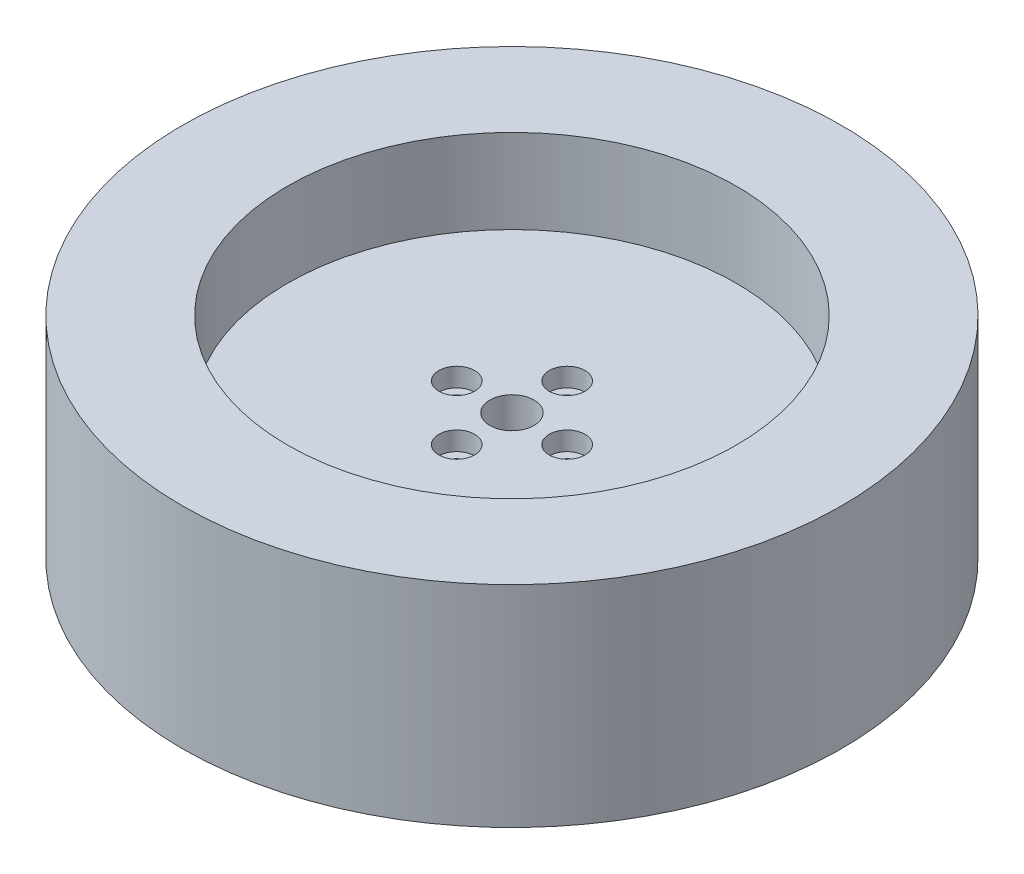
ISO-10303-21;
HEADER;
FILE_DESCRIPTION(('STEP AP214'),'2;1');
FILE_NAME('part.step','',(''),(''),'','','');
FILE_SCHEMA(('AUTOMOTIVE_DESIGN { 1 0 10303 214 1 1 1 1 }'));
ENDSEC;
DATA;
#1=APPLICATION_CONTEXT('core data for automotive mechanical design processes');
#2=APPLICATION_PROTOCOL_DEFINITION('international standard','automotive_design',2000,#1);
#3=PRODUCT_CONTEXT('',#1,'mechanical');
#4=PRODUCT('Part','Part','',(#3));
#5=PRODUCT_RELATED_PRODUCT_CATEGORY('part','',(#4));
#6=PRODUCT_DEFINITION_FORMATION('','',#4);
#7=PRODUCT_DEFINITION_CONTEXT('part definition',#1,'design');
#8=PRODUCT_DEFINITION('design','',#6,#7);
#9=PRODUCT_DEFINITION_SHAPE('','',#8);
#10=(LENGTH_UNIT() NAMED_UNIT(*) SI_UNIT(.MILLI.,.METRE.));
#11=(NAMED_UNIT(*) PLANE_ANGLE_UNIT() SI_UNIT($,.RADIAN.));
#12=(NAMED_UNIT(*) SI_UNIT($,.STERADIAN.) SOLID_ANGLE_UNIT());
#13=UNCERTAINTY_MEASURE_WITH_UNIT(LENGTH_MEASURE(1.E-05),#10,'distance_accuracy_value','');
#14=(GEOMETRIC_REPRESENTATION_CONTEXT(3) GLOBAL_UNCERTAINTY_ASSIGNED_CONTEXT((#13)) GLOBAL_UNIT_ASSIGNED_CONTEXT((#10,
#11,#12)) REPRESENTATION_CONTEXT('',''));
#15=CARTESIAN_POINT('',(0.,0.,0.));
#16=DIRECTION('',(0.,0.,1.));
#17=DIRECTION('',(1.,0.,0.));
#18=AXIS2_PLACEMENT_3D('',#15,#16,#17);
#19=CARTESIAN_POINT('',(0.,-21.19,0.));
#20=DIRECTION('',(0.,1.,0.));
#21=DIRECTION('',(0.,0.,1.));
#22=AXIS2_PLACEMENT_3D('',#19,#20,#21);
#23=CYLINDRICAL_SURFACE('',#22,4.);
#24=CARTESIAN_POINT('',(0.,3.81,0.));
#25=DIRECTION('',(0.,1.,0.));
#26=DIRECTION('',(0.,0.,1.));
#27=AXIS2_PLACEMENT_3D('',#24,#25,#26);
#28=CIRCLE('',#27,4.);
#29=CARTESIAN_POINT('',(0.,3.81,4.));
#30=VERTEX_POINT('',#29);
#31=EDGE_CURVE('E73',#30,#30,#28,.T.);
#32=ORIENTED_EDGE('',*,*,#31,.T.);
#33=EDGE_LOOP('',(#32));
#34=FACE_BOUND('',#33,.T.);
#35=CARTESIAN_POINT('',(0.,-1.81,0.));
#36=DIRECTION('',(0.,-1.,0.));
#37=DIRECTION('',(0.,0.,-1.));
#38=AXIS2_PLACEMENT_3D('',#35,#36,#37);
#39=CIRCLE('',#38,4.);
#40=CARTESIAN_POINT('',(0.,-1.81,-4.));
#41=VERTEX_POINT('',#40);
#42=EDGE_CURVE('E115',#41,#41,#39,.F.);
#43=ORIENTED_EDGE('',*,*,#42,.F.);
#44=EDGE_LOOP('',(#43));
#45=FACE_BOUND('',#44,.T.);
#46=ADVANCED_FACE('F49',(#34,#45),#23,.F.);
#47=CARTESIAN_POINT('',(0.,-6.19,10.));
#48=DIRECTION('',(0.,1.,0.));
#49=DIRECTION('',(0.,0.,1.));
#50=AXIS2_PLACEMENT_3D('',#47,#48,#49);
#51=CYLINDRICAL_SURFACE('',#50,1.7);
#52=CARTESIAN_POINT('',(0.,0.410000000000003,10.));
#53=DIRECTION('',(0.,1.,0.));
#54=DIRECTION('',(0.,0.,1.));
#55=AXIS2_PLACEMENT_3D('',#52,#53,#54);
#56=CIRCLE('',#55,1.7);
#57=CARTESIAN_POINT('',(0.,0.410000000000003,11.7));
#58=VERTEX_POINT('',#57);
#59=EDGE_CURVE('E104',#58,#58,#56,.T.);
#60=ORIENTED_EDGE('',*,*,#59,.T.);
#61=EDGE_LOOP('',(#60));
#62=FACE_BOUND('',#61,.T.);
#63=CARTESIAN_POINT('',(0.,-1.81,10.));
#64=DIRECTION('',(0.,-1.,0.));
#65=DIRECTION('',(0.,0.,-1.));
#66=AXIS2_PLACEMENT_3D('',#63,#64,#65);
#67=CIRCLE('',#66,1.7);
#68=CARTESIAN_POINT('',(0.,-1.81,8.3));
#69=VERTEX_POINT('',#68);
#70=EDGE_CURVE('E118',#69,#69,#67,.F.);
#71=ORIENTED_EDGE('',*,*,#70,.F.);
#72=EDGE_LOOP('',(#71));
#73=FACE_BOUND('',#72,.T.);
#74=ADVANCED_FACE('F155',(#62,#73),#51,.F.);
#75=CARTESIAN_POINT('',(-10.,-6.19,1.05969086964441E-13));
#76=DIRECTION('',(0.,1.,0.));
#77=DIRECTION('',(0.,0.,1.));
#78=AXIS2_PLACEMENT_3D('',#75,#76,#77);
#79=CYLINDRICAL_SURFACE('',#78,1.7);
#80=CARTESIAN_POINT('',(-10.,0.410000000000003,1.05969086964441E-13));
#81=DIRECTION('',(0.,1.,0.));
#82=DIRECTION('',(0.,0.,1.));
#83=AXIS2_PLACEMENT_3D('',#80,#81,#82);
#84=CIRCLE('',#83,1.7);
#85=CARTESIAN_POINT('',(-10.,0.410000000000003,1.7000000000001));
#86=VERTEX_POINT('',#85);
#87=EDGE_CURVE('E78',#86,#86,#84,.T.);
#88=ORIENTED_EDGE('',*,*,#87,.T.);
#89=EDGE_LOOP('',(#88));
#90=FACE_BOUND('',#89,.T.);
#91=CARTESIAN_POINT('',(-10.,-1.81,1.05969086964441E-13));
#92=DIRECTION('',(0.,-1.,0.));
#93=DIRECTION('',(0.,0.,-1.));
#94=AXIS2_PLACEMENT_3D('',#91,#92,#93);
#95=CIRCLE('',#94,1.7);
#96=CARTESIAN_POINT('',(-10.,-1.81,-1.69999999999989));
#97=VERTEX_POINT('',#96);
#98=EDGE_CURVE('E121',#97,#97,#95,.F.);
#99=ORIENTED_EDGE('',*,*,#98,.F.);
#100=EDGE_LOOP('',(#99));
#101=FACE_BOUND('',#100,.T.);
#102=ADVANCED_FACE('F150',(#90,#101),#79,.F.);
#103=CARTESIAN_POINT('',(0.,-6.19,-10.));
#104=DIRECTION('',(0.,1.,0.));
#105=DIRECTION('',(0.,0.,1.));
#106=AXIS2_PLACEMENT_3D('',#103,#104,#105);
#107=CYLINDRICAL_SURFACE('',#106,1.7);
#108=CARTESIAN_POINT('',(0.,0.410000000000003,-10.));
#109=DIRECTION('',(0.,1.,0.));
#110=DIRECTION('',(0.,0.,1.));
#111=AXIS2_PLACEMENT_3D('',#108,#109,#110);
#112=CIRCLE('',#111,1.7);
#113=CARTESIAN_POINT('',(0.,0.410000000000003,-8.3));
#114=VERTEX_POINT('',#113);
#115=EDGE_CURVE('E87',#114,#114,#112,.T.);
#116=ORIENTED_EDGE('',*,*,#115,.T.);
#117=EDGE_LOOP('',(#116));
#118=FACE_BOUND('',#117,.T.);
#119=CARTESIAN_POINT('',(0.,-1.81,-10.));
#120=DIRECTION('',(0.,-1.,0.));
#121=DIRECTION('',(0.,0.,-1.));
#122=AXIS2_PLACEMENT_3D('',#119,#120,#121);
#123=CIRCLE('',#122,1.7);
#124=CARTESIAN_POINT('',(0.,-1.81,-11.7));
#125=VERTEX_POINT('',#124);
#126=EDGE_CURVE('E124',#125,#125,#123,.F.);
#127=ORIENTED_EDGE('',*,*,#126,.F.);
#128=EDGE_LOOP('',(#127));
#129=FACE_BOUND('',#128,.T.);
#130=ADVANCED_FACE('F142',(#118,#129),#107,.F.);
#131=CARTESIAN_POINT('',(10.,-6.19,0.));
#132=DIRECTION('',(0.,1.,0.));
#133=DIRECTION('',(0.,0.,1.));
#134=AXIS2_PLACEMENT_3D('',#131,#132,#133);
#135=CYLINDRICAL_SURFACE('',#134,1.7);
#136=CARTESIAN_POINT('',(10.,0.410000000000003,0.));
#137=DIRECTION('',(0.,1.,0.));
#138=DIRECTION('',(0.,0.,1.));
#139=AXIS2_PLACEMENT_3D('',#136,#137,#138);
#140=CIRCLE('',#139,1.7);
#141=CARTESIAN_POINT('',(10.,0.410000000000003,1.69999999999996));
#142=VERTEX_POINT('',#141);
#143=EDGE_CURVE('E96',#142,#142,#140,.T.);
#144=ORIENTED_EDGE('',*,*,#143,.T.);
#145=EDGE_LOOP('',(#144));
#146=FACE_BOUND('',#145,.T.);
#147=CARTESIAN_POINT('',(10.,-1.81,0.));
#148=DIRECTION('',(0.,-1.,0.));
#149=DIRECTION('',(0.,0.,-1.));
#150=AXIS2_PLACEMENT_3D('',#147,#148,#149);
#151=CIRCLE('',#150,1.7);
#152=CARTESIAN_POINT('',(10.,-1.81,-1.70000000000004));
#153=VERTEX_POINT('',#152);
#154=EDGE_CURVE('E53',#153,#153,#151,.F.);
#155=ORIENTED_EDGE('',*,*,#154,.F.);
#156=EDGE_LOOP('',(#155));
#157=FACE_BOUND('',#156,.T.);
#158=ADVANCED_FACE('F140',(#146,#157),#135,.F.);
#159=CARTESIAN_POINT('',(0.,-19.05,0.));
#160=DIRECTION('',(0.,1.,0.));
#161=DIRECTION('',(0.,0.,1.));
#162=AXIS2_PLACEMENT_3D('',#159,#160,#161);
#163=CYLINDRICAL_SURFACE('',#162,59.69);
#164=CARTESIAN_POINT('',(0.,-19.05,0.));
#165=DIRECTION('',(0.,1.,0.));
#166=DIRECTION('',(0.,0.,1.));
#167=AXIS2_PLACEMENT_3D('',#164,#165,#166);
#168=CIRCLE('',#167,59.69);
#169=CARTESIAN_POINT('',(0.,-19.05,59.69));
#170=VERTEX_POINT('',#169);
#171=EDGE_CURVE('E11',#170,#170,#168,.T.);
#172=ORIENTED_EDGE('',*,*,#171,.T.);
#173=EDGE_LOOP('',(#172));
#174=FACE_BOUND('',#173,.T.);
#175=CARTESIAN_POINT('',(0.,19.05,0.));
#176=DIRECTION('',(0.,1.,0.));
#177=DIRECTION('',(0.,0.,1.));
#178=AXIS2_PLACEMENT_3D('',#175,#176,#177);
#179=CIRCLE('',#178,59.69);
#180=CARTESIAN_POINT('',(0.,19.05,59.69));
#181=VERTEX_POINT('',#180);
#182=EDGE_CURVE('E57',#181,#181,#179,.T.);
#183=ORIENTED_EDGE('',*,*,#182,.F.);
#184=EDGE_LOOP('',(#183));
#185=FACE_BOUND('',#184,.T.);
#186=ADVANCED_FACE('F51',(#174,#185),#163,.T.);
#187=CARTESIAN_POINT('',(0.,-19.05,0.));
#188=DIRECTION('',(0.,1.,0.));
#189=DIRECTION('',(0.,0.,1.));
#190=AXIS2_PLACEMENT_3D('',#187,#188,#189);
#191=PLANE('',#190);
#192=CARTESIAN_POINT('',(0.,-19.05,0.));
#193=DIRECTION('',(0.,-1.,0.));
#194=DIRECTION('',(0.,0.,-1.));
#195=AXIS2_PLACEMENT_3D('',#192,#193,#194);
#196=CIRCLE('',#195,40.64);
#197=CARTESIAN_POINT('',(0.,-19.05,-40.64));
#198=VERTEX_POINT('',#197);
#199=EDGE_CURVE('E64',#198,#198,#196,.T.);
#200=ORIENTED_EDGE('',*,*,#199,.F.);
#201=EDGE_LOOP('',(#200));
#202=FACE_BOUND('',#201,.T.);
#203=ORIENTED_EDGE('',*,*,#171,.F.);
#204=EDGE_LOOP('',(#203));
#205=FACE_BOUND('',#204,.T.);
#206=ADVANCED_FACE('F149',(#202,#205),#191,.F.);
#207=CARTESIAN_POINT('',(0.,19.05,0.));
#208=DIRECTION('',(0.,1.,0.));
#209=DIRECTION('',(0.,0.,1.));
#210=AXIS2_PLACEMENT_3D('',#207,#208,#209);
#211=PLANE('',#210);
#212=CARTESIAN_POINT('',(0.,19.05,0.));
#213=DIRECTION('',(0.,1.,0.));
#214=DIRECTION('',(0.,0.,1.));
#215=AXIS2_PLACEMENT_3D('',#212,#213,#214);
#216=CIRCLE('',#215,40.64);
#217=CARTESIAN_POINT('',(0.,19.05,40.64));
#218=VERTEX_POINT('',#217);
#219=EDGE_CURVE('E70',#218,#218,#216,.T.);
#220=ORIENTED_EDGE('',*,*,#219,.F.);
#221=EDGE_LOOP('',(#220));
#222=FACE_BOUND('',#221,.T.);
#223=ORIENTED_EDGE('',*,*,#182,.T.);
#224=EDGE_LOOP('',(#223));
#225=FACE_BOUND('',#224,.T.);
#226=ADVANCED_FACE('F181',(#222,#225),#211,.T.);
#227=CARTESIAN_POINT('',(0.,-3.81,0.));
#228=DIRECTION('',(0.,-1.,0.));
#229=DIRECTION('',(0.,0.,-1.));
#230=AXIS2_PLACEMENT_3D('',#227,#228,#229);
#231=CYLINDRICAL_SURFACE('',#230,40.64);
#232=CARTESIAN_POINT('',(0.,-3.81,0.));
#233=DIRECTION('',(0.,-1.,0.));
#234=DIRECTION('',(0.,0.,-1.));
#235=AXIS2_PLACEMENT_3D('',#232,#233,#234);
#236=CIRCLE('',#235,40.64);
#237=CARTESIAN_POINT('',(0.,-3.81,-40.64));
#238=VERTEX_POINT('',#237);
#239=EDGE_CURVE('E61',#238,#238,#236,.T.);
#240=ORIENTED_EDGE('',*,*,#239,.F.);
#241=EDGE_LOOP('',(#240));
#242=FACE_BOUND('',#241,.T.);
#243=ORIENTED_EDGE('',*,*,#199,.T.);
#244=EDGE_LOOP('',(#243));
#245=FACE_BOUND('',#244,.T.);
#246=ADVANCED_FACE('F177',(#242,#245),#231,.F.);
#247=CARTESIAN_POINT('',(0.,-3.81,0.));
#248=DIRECTION('',(0.,-1.,0.));
#249=DIRECTION('',(0.,0.,-1.));
#250=AXIS2_PLACEMENT_3D('',#247,#248,#249);
#251=PLANE('',#250);
#252=CARTESIAN_POINT('',(0.,-3.81,0.));
#253=DIRECTION('',(0.,-1.,0.));
#254=DIRECTION('',(0.,0.,-1.));
#255=AXIS2_PLACEMENT_3D('',#252,#253,#254);
#256=CIRCLE('',#255,15.);
#257=CARTESIAN_POINT('',(0.,-3.81,-15.));
#258=VERTEX_POINT('',#257);
#259=EDGE_CURVE('E127',#258,#258,#256,.T.);
#260=ORIENTED_EDGE('',*,*,#259,.F.);
#261=EDGE_LOOP('',(#260));
#262=FACE_BOUND('',#261,.T.);
#263=ORIENTED_EDGE('',*,*,#239,.T.);
#264=EDGE_LOOP('',(#263));
#265=FACE_BOUND('',#264,.T.);
#266=ADVANCED_FACE('F173',(#262,#265),#251,.T.);
#267=CARTESIAN_POINT('',(0.,3.81,0.));
#268=DIRECTION('',(0.,1.,0.));
#269=DIRECTION('',(0.,0.,1.));
#270=AXIS2_PLACEMENT_3D('',#267,#268,#269);
#271=CYLINDRICAL_SURFACE('',#270,40.64);
#272=CARTESIAN_POINT('',(0.,3.81,0.));
#273=DIRECTION('',(0.,1.,0.));
#274=DIRECTION('',(0.,0.,1.));
#275=AXIS2_PLACEMENT_3D('',#272,#273,#274);
#276=CIRCLE('',#275,40.64);
#277=CARTESIAN_POINT('',(0.,3.81,40.64));
#278=VERTEX_POINT('',#277);
#279=EDGE_CURVE('E67',#278,#278,#276,.T.);
#280=ORIENTED_EDGE('',*,*,#279,.F.);
#281=EDGE_LOOP('',(#280));
#282=FACE_BOUND('',#281,.T.);
#283=ORIENTED_EDGE('',*,*,#219,.T.);
#284=EDGE_LOOP('',(#283));
#285=FACE_BOUND('',#284,.T.);
#286=ADVANCED_FACE('F169',(#282,#285),#271,.F.);
#287=CARTESIAN_POINT('',(0.,3.81,0.));
#288=DIRECTION('',(0.,1.,0.));
#289=DIRECTION('',(0.,0.,1.));
#290=AXIS2_PLACEMENT_3D('',#287,#288,#289);
#291=PLANE('',#290);
#292=CARTESIAN_POINT('',(0.,3.81,10.));
#293=DIRECTION('',(0.,1.,0.));
#294=DIRECTION('',(0.,0.,1.));
#295=AXIS2_PLACEMENT_3D('',#292,#293,#294);
#296=CIRCLE('',#295,3.25);
#297=CARTESIAN_POINT('',(0.,3.81,13.25));
#298=VERTEX_POINT('',#297);
#299=EDGE_CURVE('E112',#298,#298,#296,.T.);
#300=ORIENTED_EDGE('',*,*,#299,.F.);
#301=EDGE_LOOP('',(#300));
#302=FACE_BOUND('',#301,.T.);
#303=CARTESIAN_POINT('',(10.,3.81,0.));
#304=DIRECTION('',(0.,1.,0.));
#305=DIRECTION('',(0.,0.,1.));
#306=AXIS2_PLACEMENT_3D('',#303,#304,#305);
#307=CIRCLE('',#306,3.25);
#308=CARTESIAN_POINT('',(10.,3.81,3.24999999999996));
#309=VERTEX_POINT('',#308);
#310=EDGE_CURVE('E102',#309,#309,#307,.T.);
#311=ORIENTED_EDGE('',*,*,#310,.F.);
#312=EDGE_LOOP('',(#311));
#313=FACE_BOUND('',#312,.T.);
#314=CARTESIAN_POINT('',(0.,3.81,-10.));
#315=DIRECTION('',(0.,1.,0.));
#316=DIRECTION('',(0.,0.,1.));
#317=AXIS2_PLACEMENT_3D('',#314,#315,#316);
#318=CIRCLE('',#317,3.25);
#319=CARTESIAN_POINT('',(0.,3.81,-6.75));
#320=VERTEX_POINT('',#319);
#321=EDGE_CURVE('E93',#320,#320,#318,.T.);
#322=ORIENTED_EDGE('',*,*,#321,.F.);
#323=EDGE_LOOP('',(#322));
#324=FACE_BOUND('',#323,.T.);
#325=CARTESIAN_POINT('',(-10.,3.81,1.05969086964441E-13));
#326=DIRECTION('',(0.,1.,0.));
#327=DIRECTION('',(0.,0.,1.));
#328=AXIS2_PLACEMENT_3D('',#325,#326,#327);
#329=CIRCLE('',#328,3.25);
#330=CARTESIAN_POINT('',(-10.,3.81,3.25000000000011));
#331=VERTEX_POINT('',#330);
#332=EDGE_CURVE('E84',#331,#331,#329,.T.);
#333=ORIENTED_EDGE('',*,*,#332,.F.);
#334=EDGE_LOOP('',(#333));
#335=FACE_BOUND('',#334,.T.);
#336=ORIENTED_EDGE('',*,*,#31,.F.);
#337=EDGE_LOOP('',(#336));
#338=FACE_BOUND('',#337,.T.);
#339=ORIENTED_EDGE('',*,*,#279,.T.);
#340=EDGE_LOOP('',(#339));
#341=FACE_BOUND('',#340,.T.);
#342=ADVANCED_FACE('F165',(#302,#313,#324,#335,#338,#341),#291,.T.);
#343=CARTESIAN_POINT('',(-8.3,0.410000000000003,1.05969086964441E-13));
#344=DIRECTION('',(0.,-1.,0.));
#345=DIRECTION('',(0.,0.,-1.));
#346=AXIS2_PLACEMENT_3D('',#343,#344,#345);
#347=PLANE('',#346);
#348=ORIENTED_EDGE('',*,*,#87,.F.);
#349=EDGE_LOOP('',(#348));
#350=FACE_BOUND('',#349,.T.);
#351=CARTESIAN_POINT('',(-10.,0.410000000000003,1.05969086964441E-13));
#352=DIRECTION('',(0.,1.,0.));
#353=DIRECTION('',(0.,0.,1.));
#354=AXIS2_PLACEMENT_3D('',#351,#352,#353);
#355=CIRCLE('',#354,3.25);
#356=CARTESIAN_POINT('',(-10.,0.410000000000003,3.25000000000011));
#357=VERTEX_POINT('',#356);
#358=EDGE_CURVE('E81',#357,#357,#355,.T.);
#359=ORIENTED_EDGE('',*,*,#358,.T.);
#360=EDGE_LOOP('',(#359));
#361=FACE_BOUND('',#360,.T.);
#362=ADVANCED_FACE('F168',(#350,#361),#347,.F.);
#363=CARTESIAN_POINT('',(-10.,3.81,1.05969086964441E-13));
#364=DIRECTION('',(0.,1.,0.));
#365=DIRECTION('',(0.,0.,1.));
#366=AXIS2_PLACEMENT_3D('',#363,#364,#365);
#367=CYLINDRICAL_SURFACE('',#366,3.25);
#368=ORIENTED_EDGE('',*,*,#358,.F.);
#369=EDGE_LOOP('',(#368));
#370=FACE_BOUND('',#369,.T.);
#371=ORIENTED_EDGE('',*,*,#332,.T.);
#372=EDGE_LOOP('',(#371));
#373=FACE_BOUND('',#372,.T.);
#374=ADVANCED_FACE('F222',(#370,#373),#367,.F.);
#375=CARTESIAN_POINT('',(1.7,0.410000000000003,-10.));
#376=DIRECTION('',(0.,-1.,0.));
#377=DIRECTION('',(0.,0.,-1.));
#378=AXIS2_PLACEMENT_3D('',#375,#376,#377);
#379=PLANE('',#378);
#380=ORIENTED_EDGE('',*,*,#115,.F.);
#381=EDGE_LOOP('',(#380));
#382=FACE_BOUND('',#381,.T.);
#383=CARTESIAN_POINT('',(0.,0.410000000000003,-10.));
#384=DIRECTION('',(0.,1.,0.));
#385=DIRECTION('',(0.,0.,1.));
#386=AXIS2_PLACEMENT_3D('',#383,#384,#385);
#387=CIRCLE('',#386,3.25);
#388=CARTESIAN_POINT('',(0.,0.410000000000003,-6.75));
#389=VERTEX_POINT('',#388);
#390=EDGE_CURVE('E90',#389,#389,#387,.T.);
#391=ORIENTED_EDGE('',*,*,#390,.T.);
#392=EDGE_LOOP('',(#391));
#393=FACE_BOUND('',#392,.T.);
#394=ADVANCED_FACE('F230',(#382,#393),#379,.F.);
#395=CARTESIAN_POINT('',(0.,3.81,-10.));
#396=DIRECTION('',(0.,1.,0.));
#397=DIRECTION('',(0.,0.,1.));
#398=AXIS2_PLACEMENT_3D('',#395,#396,#397);
#399=CYLINDRICAL_SURFACE('',#398,3.25);
#400=ORIENTED_EDGE('',*,*,#390,.F.);
#401=EDGE_LOOP('',(#400));
#402=FACE_BOUND('',#401,.T.);
#403=ORIENTED_EDGE('',*,*,#321,.T.);
#404=EDGE_LOOP('',(#403));
#405=FACE_BOUND('',#404,.T.);
#406=ADVANCED_FACE('F239',(#402,#405),#399,.F.);
#407=CARTESIAN_POINT('',(11.7,0.410000000000003,0.));
#408=DIRECTION('',(0.,-1.,0.));
#409=DIRECTION('',(0.,0.,-1.));
#410=AXIS2_PLACEMENT_3D('',#407,#408,#409);
#411=PLANE('',#410);
#412=ORIENTED_EDGE('',*,*,#143,.F.);
#413=EDGE_LOOP('',(#412));
#414=FACE_BOUND('',#413,.T.);
#415=CARTESIAN_POINT('',(10.,0.410000000000003,0.));
#416=DIRECTION('',(0.,1.,0.));
#417=DIRECTION('',(0.,0.,1.));
#418=AXIS2_PLACEMENT_3D('',#415,#416,#417);
#419=CIRCLE('',#418,3.25);
#420=CARTESIAN_POINT('',(10.,0.410000000000003,3.24999999999996));
#421=VERTEX_POINT('',#420);
#422=EDGE_CURVE('E99',#421,#421,#419,.T.);
#423=ORIENTED_EDGE('',*,*,#422,.T.);
#424=EDGE_LOOP('',(#423));
#425=FACE_BOUND('',#424,.T.);
#426=ADVANCED_FACE('F248',(#414,#425),#411,.F.);
#427=CARTESIAN_POINT('',(10.,3.81,0.));
#428=DIRECTION('',(0.,1.,0.));
#429=DIRECTION('',(0.,0.,1.));
#430=AXIS2_PLACEMENT_3D('',#427,#428,#429);
#431=CYLINDRICAL_SURFACE('',#430,3.25);
#432=ORIENTED_EDGE('',*,*,#422,.F.);
#433=EDGE_LOOP('',(#432));
#434=FACE_BOUND('',#433,.T.);
#435=ORIENTED_EDGE('',*,*,#310,.T.);
#436=EDGE_LOOP('',(#435));
#437=FACE_BOUND('',#436,.T.);
#438=ADVANCED_FACE('F257',(#434,#437),#431,.F.);
#439=CARTESIAN_POINT('',(1.7,0.410000000000003,10.));
#440=DIRECTION('',(0.,-1.,0.));
#441=DIRECTION('',(0.,0.,-1.));
#442=AXIS2_PLACEMENT_3D('',#439,#440,#441);
#443=PLANE('',#442);
#444=ORIENTED_EDGE('',*,*,#59,.F.);
#445=EDGE_LOOP('',(#444));
#446=FACE_BOUND('',#445,.T.);
#447=CARTESIAN_POINT('',(0.,0.410000000000003,10.));
#448=DIRECTION('',(0.,1.,0.));
#449=DIRECTION('',(0.,0.,1.));
#450=AXIS2_PLACEMENT_3D('',#447,#448,#449);
#451=CIRCLE('',#450,3.25);
#452=CARTESIAN_POINT('',(0.,0.410000000000003,13.25));
#453=VERTEX_POINT('',#452);
#454=EDGE_CURVE('E109',#453,#453,#451,.T.);
#455=ORIENTED_EDGE('',*,*,#454,.T.);
#456=EDGE_LOOP('',(#455));
#457=FACE_BOUND('',#456,.T.);
#458=ADVANCED_FACE('F266',(#446,#457),#443,.F.);
#459=CARTESIAN_POINT('',(0.,3.81,10.));
#460=DIRECTION('',(0.,1.,0.));
#461=DIRECTION('',(0.,0.,1.));
#462=AXIS2_PLACEMENT_3D('',#459,#460,#461);
#463=CYLINDRICAL_SURFACE('',#462,3.25);
#464=ORIENTED_EDGE('',*,*,#454,.F.);
#465=EDGE_LOOP('',(#464));
#466=FACE_BOUND('',#465,.T.);
#467=ORIENTED_EDGE('',*,*,#299,.T.);
#468=EDGE_LOOP('',(#467));
#469=FACE_BOUND('',#468,.T.);
#470=ADVANCED_FACE('F275',(#466,#469),#463,.F.);
#471=CARTESIAN_POINT('',(0.,-1.81,0.));
#472=DIRECTION('',(0.,-1.,0.));
#473=DIRECTION('',(0.,0.,-1.));
#474=AXIS2_PLACEMENT_3D('',#471,#472,#473);
#475=PLANE('',#474);
#476=CARTESIAN_POINT('',(0.,-1.81,0.));
#477=DIRECTION('',(0.,-1.,0.));
#478=DIRECTION('',(0.,0.,-1.));
#479=AXIS2_PLACEMENT_3D('',#476,#477,#478);
#480=CIRCLE('',#479,15.);
#481=CARTESIAN_POINT('',(0.,-1.81,-15.));
#482=VERTEX_POINT('',#481);
#483=EDGE_CURVE('E130',#482,#482,#480,.T.);
#484=ORIENTED_EDGE('',*,*,#483,.T.);
#485=EDGE_LOOP('',(#484));
#486=FACE_BOUND('',#485,.T.);
#487=ORIENTED_EDGE('',*,*,#154,.T.);
#488=EDGE_LOOP('',(#487));
#489=FACE_BOUND('',#488,.T.);
#490=ORIENTED_EDGE('',*,*,#126,.T.);
#491=EDGE_LOOP('',(#490));
#492=FACE_BOUND('',#491,.T.);
#493=ORIENTED_EDGE('',*,*,#98,.T.);
#494=EDGE_LOOP('',(#493));
#495=FACE_BOUND('',#494,.T.);
#496=ORIENTED_EDGE('',*,*,#70,.T.);
#497=EDGE_LOOP('',(#496));
#498=FACE_BOUND('',#497,.T.);
#499=ORIENTED_EDGE('',*,*,#42,.T.);
#500=EDGE_LOOP('',(#499));
#501=FACE_BOUND('',#500,.T.);
#502=ADVANCED_FACE('F137',(#486,#489,#492,#495,#498,#501),#475,.T.);
#503=CARTESIAN_POINT('',(0.,-1.81,0.));
#504=DIRECTION('',(0.,-1.,0.));
#505=DIRECTION('',(0.,0.,-1.));
#506=AXIS2_PLACEMENT_3D('',#503,#504,#505);
#507=CYLINDRICAL_SURFACE('',#506,15.);
#508=ORIENTED_EDGE('',*,*,#483,.F.);
#509=EDGE_LOOP('',(#508));
#510=FACE_BOUND('',#509,.T.);
#511=ORIENTED_EDGE('',*,*,#259,.T.);
#512=EDGE_LOOP('',(#511));
#513=FACE_BOUND('',#512,.T.);
#514=ADVANCED_FACE('F321',(#510,#513),#507,.F.);
#515=CLOSED_SHELL('',(#46,#74,#102,#130,#158,#186,#206,#226,#246,#266,#286,#342,#362,#374,#394,
#406,#426,#438,#458,#470,#502,#514));
#516=MANIFOLD_SOLID_BREP('B2',#515);
#517=ADVANCED_BREP_SHAPE_REPRESENTATION('',(#18,#516),#14);
#518=SHAPE_DEFINITION_REPRESENTATION(#9,#517);
ENDSEC;
END-ISO-10303-21;
